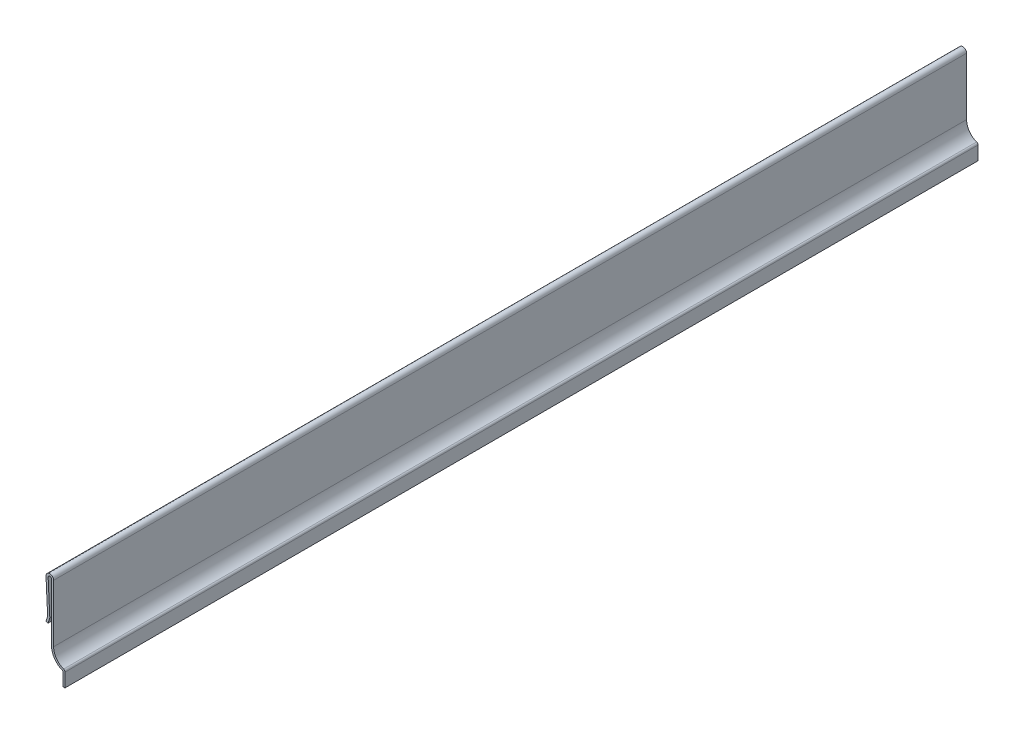
ISO-10303-21;
HEADER;
FILE_DESCRIPTION(('STEP AP214'),'2;1');
FILE_NAME('part.step','',(''),(''),'','','');
FILE_SCHEMA(('AUTOMOTIVE_DESIGN { 1 0 10303 214 1 1 1 1 }'));
ENDSEC;
DATA;
#1=APPLICATION_CONTEXT('core data for automotive mechanical design processes');
#2=APPLICATION_PROTOCOL_DEFINITION('international standard','automotive_design',2000,#1);
#3=PRODUCT_CONTEXT('',#1,'mechanical');
#4=PRODUCT('Part','Part','',(#3));
#5=PRODUCT_RELATED_PRODUCT_CATEGORY('part','',(#4));
#6=PRODUCT_DEFINITION_FORMATION('','',#4);
#7=PRODUCT_DEFINITION_CONTEXT('part definition',#1,'design');
#8=PRODUCT_DEFINITION('design','',#6,#7);
#9=PRODUCT_DEFINITION_SHAPE('','',#8);
#10=(LENGTH_UNIT() NAMED_UNIT(*) SI_UNIT(.MILLI.,.METRE.));
#11=(NAMED_UNIT(*) PLANE_ANGLE_UNIT() SI_UNIT($,.RADIAN.));
#12=(NAMED_UNIT(*) SI_UNIT($,.STERADIAN.) SOLID_ANGLE_UNIT());
#13=UNCERTAINTY_MEASURE_WITH_UNIT(LENGTH_MEASURE(1.E-05),#10,'distance_accuracy_value','');
#14=(GEOMETRIC_REPRESENTATION_CONTEXT(3) GLOBAL_UNCERTAINTY_ASSIGNED_CONTEXT((#13)) GLOBAL_UNIT_ASSIGNED_CONTEXT((#10,
#11,#12)) REPRESENTATION_CONTEXT('',''));
#15=CARTESIAN_POINT('',(0.,0.,0.));
#16=DIRECTION('',(0.,0.,1.));
#17=DIRECTION('',(1.,0.,0.));
#18=AXIS2_PLACEMENT_3D('',#15,#16,#17);
#19=CARTESIAN_POINT('',(0.,0.,-381.));
#20=DIRECTION('',(0.,-1.,0.));
#21=DIRECTION('',(0.,0.,-1.));
#22=AXIS2_PLACEMENT_3D('',#19,#20,#21);
#23=PLANE('',#22);
#24=DIRECTION('',(1.,0.,0.));
#25=VECTOR('',#24,1.);
#26=CARTESIAN_POINT('',(0.,0.,0.));
#27=LINE('',#26,#25);
#28=CARTESIAN_POINT('',(-0.889,0.,0.));
#29=VERTEX_POINT('',#28);
#30=CARTESIAN_POINT('',(0.,0.,0.));
#31=VERTEX_POINT('',#30);
#32=EDGE_CURVE('E211',#29,#31,#27,.T.);
#33=ORIENTED_EDGE('',*,*,#32,.F.);
#34=DIRECTION('',(0.,0.,1.));
#35=VECTOR('',#34,1.);
#36=CARTESIAN_POINT('',(-0.889,0.,-381.));
#37=LINE('',#36,#35);
#38=CARTESIAN_POINT('',(-0.889,0.,-381.));
#39=VERTEX_POINT('',#38);
#40=EDGE_CURVE('E169',#39,#29,#37,.T.);
#41=ORIENTED_EDGE('',*,*,#40,.F.);
#42=DIRECTION('',(1.,0.,0.));
#43=VECTOR('',#42,1.);
#44=CARTESIAN_POINT('',(0.,0.,-381.));
#45=LINE('',#44,#43);
#46=CARTESIAN_POINT('',(0.,0.,-381.));
#47=VERTEX_POINT('',#46);
#48=EDGE_CURVE('E164',#39,#47,#45,.T.);
#49=ORIENTED_EDGE('',*,*,#48,.T.);
#50=DIRECTION('',(0.,0.,1.));
#51=VECTOR('',#50,1.);
#52=CARTESIAN_POINT('',(0.,0.,-381.));
#53=LINE('',#52,#51);
#54=EDGE_CURVE('E146',#47,#31,#53,.T.);
#55=ORIENTED_EDGE('',*,*,#54,.T.);
#56=EDGE_LOOP('',(#33,#41,#49,#55));
#57=FACE_BOUND('',#56,.T.);
#58=ADVANCED_FACE('F35',(#57),#23,.T.);
#59=CARTESIAN_POINT('',(-0.889,0.,-381.));
#60=DIRECTION('',(-1.,0.,0.));
#61=DIRECTION('',(0.,0.,1.));
#62=AXIS2_PLACEMENT_3D('',#59,#60,#61);
#63=PLANE('',#62);
#64=DIRECTION('',(0.,-1.,0.));
#65=VECTOR('',#64,1.);
#66=CARTESIAN_POINT('',(-0.889,0.,0.));
#67=LINE('',#66,#65);
#68=CARTESIAN_POINT('',(-0.888999999999998,5.69615048391721,0.));
#69=VERTEX_POINT('',#68);
#70=EDGE_CURVE('E170',#69,#29,#67,.T.);
#71=ORIENTED_EDGE('',*,*,#70,.F.);
#72=DIRECTION('',(0.,0.,1.));
#73=VECTOR('',#72,1.);
#74=CARTESIAN_POINT('',(-0.888999999999998,5.69615048391721,-381.));
#75=LINE('',#74,#73);
#76=CARTESIAN_POINT('',(-0.888999999999998,5.69615048391721,-381.));
#77=VERTEX_POINT('',#76);
#78=EDGE_CURVE('E250',#77,#69,#75,.T.);
#79=ORIENTED_EDGE('',*,*,#78,.F.);
#80=DIRECTION('',(0.,-1.,0.));
#81=VECTOR('',#80,1.);
#82=CARTESIAN_POINT('',(-0.889,0.,-381.));
#83=LINE('',#82,#81);
#84=EDGE_CURVE('E158',#77,#39,#83,.T.);
#85=ORIENTED_EDGE('',*,*,#84,.T.);
#86=ORIENTED_EDGE('',*,*,#40,.T.);
#87=EDGE_LOOP('',(#71,#79,#85,#86));
#88=FACE_BOUND('',#87,.T.);
#89=ADVANCED_FACE('F280',(#88),#63,.T.);
#90=CARTESIAN_POINT('',(1.5875,12.4983610621043,-381.));
#91=DIRECTION('',(0.,0.,1.));
#92=DIRECTION('',(1.,0.,0.));
#93=AXIS2_PLACEMENT_3D('',#90,#91,#92);
#94=CYLINDRICAL_SURFACE('',#93,7.239);
#95=CARTESIAN_POINT('',(1.5875,12.4983610621043,0.));
#96=DIRECTION('',(0.,0.,1.));
#97=DIRECTION('',(-1.,0.,0.));
#98=AXIS2_PLACEMENT_3D('',#95,#96,#97);
#99=CIRCLE('',#98,7.239);
#100=CARTESIAN_POINT('',(-5.6515,12.4983610621043,0.));
#101=VERTEX_POINT('',#100);
#102=EDGE_CURVE('E173',#101,#69,#99,.T.);
#103=ORIENTED_EDGE('',*,*,#102,.F.);
#104=DIRECTION('',(0.,0.,1.));
#105=VECTOR('',#104,1.);
#106=CARTESIAN_POINT('',(-5.6515,12.4983610621043,-381.));
#107=LINE('',#106,#105);
#108=CARTESIAN_POINT('',(-5.6515,12.4983610621043,-381.));
#109=VERTEX_POINT('',#108);
#110=EDGE_CURVE('E252',#109,#101,#107,.T.);
#111=ORIENTED_EDGE('',*,*,#110,.F.);
#112=CARTESIAN_POINT('',(1.5875,12.4983610621043,-381.));
#113=DIRECTION('',(0.,0.,1.));
#114=DIRECTION('',(-1.,0.,0.));
#115=AXIS2_PLACEMENT_3D('',#112,#113,#114);
#116=CIRCLE('',#115,7.239);
#117=EDGE_CURVE('E207',#109,#77,#116,.T.);
#118=ORIENTED_EDGE('',*,*,#117,.T.);
#119=ORIENTED_EDGE('',*,*,#78,.T.);
#120=EDGE_LOOP('',(#103,#111,#118,#119));
#121=FACE_BOUND('',#120,.T.);
#122=ADVANCED_FACE('F333',(#121),#94,.T.);
#123=CARTESIAN_POINT('',(-5.6515,12.4983610621043,-381.));
#124=DIRECTION('',(-1.,0.,0.));
#125=DIRECTION('',(0.,0.,1.));
#126=AXIS2_PLACEMENT_3D('',#123,#124,#125);
#127=PLANE('',#126);
#128=DIRECTION('',(0.,-1.,0.));
#129=VECTOR('',#128,1.);
#130=CARTESIAN_POINT('',(-5.6515,12.4983610621043,0.));
#131=LINE('',#130,#129);
#132=CARTESIAN_POINT('',(-5.6515,36.5125,0.));
#133=VERTEX_POINT('',#132);
#134=EDGE_CURVE('E243',#133,#101,#131,.T.);
#135=ORIENTED_EDGE('',*,*,#134,.F.);
#136=DIRECTION('',(0.,0.,1.));
#137=VECTOR('',#136,1.);
#138=CARTESIAN_POINT('',(-5.6515,36.5125,-381.));
#139=LINE('',#138,#137);
#140=CARTESIAN_POINT('',(-5.6515,36.5125,-381.));
#141=VERTEX_POINT('',#140);
#142=EDGE_CURVE('E254',#141,#133,#139,.T.);
#143=ORIENTED_EDGE('',*,*,#142,.F.);
#144=DIRECTION('',(0.,-1.,0.));
#145=VECTOR('',#144,1.);
#146=CARTESIAN_POINT('',(-5.6515,12.4983610621043,-381.));
#147=LINE('',#146,#145);
#148=EDGE_CURVE('E204',#141,#109,#147,.T.);
#149=ORIENTED_EDGE('',*,*,#148,.T.);
#150=ORIENTED_EDGE('',*,*,#110,.T.);
#151=EDGE_LOOP('',(#135,#143,#149,#150));
#152=FACE_BOUND('',#151,.T.);
#153=ADVANCED_FACE('F287',(#152),#127,.T.);
#154=CARTESIAN_POINT('',(-6.35,36.5125,-381.));
#155=DIRECTION('',(0.,0.,1.));
#156=DIRECTION('',(1.,0.,0.));
#157=AXIS2_PLACEMENT_3D('',#154,#155,#156);
#158=CYLINDRICAL_SURFACE('',#157,0.698500000000001);
#159=CARTESIAN_POINT('',(-6.35,36.5125,0.));
#160=DIRECTION('',(0.,0.,-1.));
#161=DIRECTION('',(1.,0.,0.));
#162=AXIS2_PLACEMENT_3D('',#159,#160,#161);
#163=CIRCLE('',#162,0.698500000000001);
#164=CARTESIAN_POINT('',(-7.04767876123071,36.4786385746375,0.));
#165=VERTEX_POINT('',#164);
#166=EDGE_CURVE('E240',#165,#133,#163,.T.);
#167=ORIENTED_EDGE('',*,*,#166,.F.);
#168=DIRECTION('',(0.,0.,1.));
#169=VECTOR('',#168,1.);
#170=CARTESIAN_POINT('',(-7.04767876123071,36.4786385746375,-381.));
#171=LINE('',#170,#169);
#172=CARTESIAN_POINT('',(-7.04767876123071,36.4786385746375,-381.));
#173=VERTEX_POINT('',#172);
#174=EDGE_CURVE('E256',#173,#165,#171,.T.);
#175=ORIENTED_EDGE('',*,*,#174,.F.);
#176=CARTESIAN_POINT('',(-6.35,36.5125,-381.));
#177=DIRECTION('',(0.,0.,-1.));
#178=DIRECTION('',(1.,0.,0.));
#179=AXIS2_PLACEMENT_3D('',#176,#177,#178);
#180=CIRCLE('',#179,0.698500000000001);
#181=EDGE_CURVE('E201',#173,#141,#180,.T.);
#182=ORIENTED_EDGE('',*,*,#181,.T.);
#183=ORIENTED_EDGE('',*,*,#142,.T.);
#184=EDGE_LOOP('',(#167,#175,#182,#183));
#185=FACE_BOUND('',#184,.T.);
#186=ADVANCED_FACE('F290',(#185),#158,.F.);
#187=CARTESIAN_POINT('',(-7.04767876123071,36.4786385746375,-381.));
#188=DIRECTION('',(0.998824282363225,0.0484773448281564,0.));
#189=DIRECTION('',(-0.0484773448281564,0.998824282363225,0.));
#190=AXIS2_PLACEMENT_3D('',#187,#188,#189);
#191=PLANE('',#190);
#192=DIRECTION('',(-0.0484773448281564,0.998824282363225,0.));
#193=VECTOR('',#192,1.);
#194=CARTESIAN_POINT('',(-7.04767876123071,36.4786385746375,0.));
#195=LINE('',#194,#193);
#196=CARTESIAN_POINT('',(-6.3579785133294,22.2680963595522,0.));
#197=VERTEX_POINT('',#196);
#198=EDGE_CURVE('E237',#197,#165,#195,.T.);
#199=ORIENTED_EDGE('',*,*,#198,.F.);
#200=DIRECTION('',(0.,0.,1.));
#201=VECTOR('',#200,1.);
#202=CARTESIAN_POINT('',(-6.3579785133294,22.2680963595522,-381.));
#203=LINE('',#202,#201);
#204=CARTESIAN_POINT('',(-6.3579785133294,22.2680963595522,-381.));
#205=VERTEX_POINT('',#204);
#206=EDGE_CURVE('E258',#205,#197,#203,.T.);
#207=ORIENTED_EDGE('',*,*,#206,.F.);
#208=DIRECTION('',(-0.0484773448281564,0.998824282363225,0.));
#209=VECTOR('',#208,1.);
#210=CARTESIAN_POINT('',(-7.04767876123071,36.4786385746375,-381.));
#211=LINE('',#210,#209);
#212=EDGE_CURVE('E198',#205,#173,#211,.T.);
#213=ORIENTED_EDGE('',*,*,#212,.T.);
#214=ORIENTED_EDGE('',*,*,#174,.T.);
#215=EDGE_LOOP('',(#199,#207,#213,#214));
#216=FACE_BOUND('',#215,.T.);
#217=ADVANCED_FACE('F295',(#216),#191,.T.);
#218=CARTESIAN_POINT('',(-7.24593330035031,22.225,-381.));
#219=DIRECTION('',(0.,0.,1.));
#220=DIRECTION('',(1.,0.,0.));
#221=AXIS2_PLACEMENT_3D('',#218,#219,#220);
#222=CYLINDRICAL_SURFACE('',#221,0.888999999999999);
#223=CARTESIAN_POINT('',(-7.24593330035031,22.225,0.));
#224=DIRECTION('',(0.,0.,1.));
#225=DIRECTION('',(-1.,0.,0.));
#226=AXIS2_PLACEMENT_3D('',#223,#224,#225);
#227=CIRCLE('',#226,0.888999999999999);
#228=CARTESIAN_POINT('',(-6.40140049114408,21.9473575425584,0.));
#229=VERTEX_POINT('',#228);
#230=EDGE_CURVE('E234',#229,#197,#227,.T.);
#231=ORIENTED_EDGE('',*,*,#230,.F.);
#232=DIRECTION('',(0.,0.,1.));
#233=VECTOR('',#232,1.);
#234=CARTESIAN_POINT('',(-6.40140049114408,21.9473575425584,-381.));
#235=LINE('',#234,#233);
#236=CARTESIAN_POINT('',(-6.40140049114408,21.9473575425584,-381.));
#237=VERTEX_POINT('',#236);
#238=EDGE_CURVE('E260',#237,#229,#235,.T.);
#239=ORIENTED_EDGE('',*,*,#238,.F.);
#240=CARTESIAN_POINT('',(-7.24593330035031,22.225,-381.));
#241=DIRECTION('',(0.,0.,1.));
#242=DIRECTION('',(-1.,0.,0.));
#243=AXIS2_PLACEMENT_3D('',#240,#241,#242);
#244=CIRCLE('',#243,0.888999999999999);
#245=EDGE_CURVE('E195',#237,#205,#244,.T.);
#246=ORIENTED_EDGE('',*,*,#245,.T.);
#247=ORIENTED_EDGE('',*,*,#206,.T.);
#248=EDGE_LOOP('',(#231,#239,#246,#247));
#249=FACE_BOUND('',#248,.T.);
#250=ADVANCED_FACE('F298',(#249),#222,.T.);
#251=CARTESIAN_POINT('',(-6.40140049114408,21.9473575425584,-381.));
#252=DIRECTION('',(0.949980662774169,-0.312308726031069,0.));
#253=DIRECTION('',(0.31230872603107,0.94998066277417,0.));
#254=AXIS2_PLACEMENT_3D('',#251,#252,#253);
#255=PLANE('',#254);
#256=DIRECTION('',(0.312308726031069,0.949980662774169,0.));
#257=VECTOR('',#256,1.);
#258=CARTESIAN_POINT('',(-6.40140049114408,21.9473575425584,0.));
#259=LINE('',#258,#257);
#260=CARTESIAN_POINT('',(-7.09296719079376,19.84375,0.));
#261=VERTEX_POINT('',#260);
#262=EDGE_CURVE('E231',#261,#229,#259,.T.);
#263=ORIENTED_EDGE('',*,*,#262,.F.);
#264=DIRECTION('',(0.,0.,1.));
#265=VECTOR('',#264,1.);
#266=CARTESIAN_POINT('',(-7.09296719079376,19.84375,-381.));
#267=LINE('',#266,#265);
#268=CARTESIAN_POINT('',(-7.09296719079376,19.84375,-381.));
#269=VERTEX_POINT('',#268);
#270=EDGE_CURVE('E262',#269,#261,#267,.T.);
#271=ORIENTED_EDGE('',*,*,#270,.F.);
#272=DIRECTION('',(0.312308726031069,0.949980662774169,0.));
#273=VECTOR('',#272,1.);
#274=CARTESIAN_POINT('',(-6.40140049114408,21.9473575425584,-381.));
#275=LINE('',#274,#273);
#276=EDGE_CURVE('E192',#269,#237,#275,.T.);
#277=ORIENTED_EDGE('',*,*,#276,.T.);
#278=ORIENTED_EDGE('',*,*,#238,.T.);
#279=EDGE_LOOP('',(#263,#271,#277,#278));
#280=FACE_BOUND('',#279,.T.);
#281=ADVANCED_FACE('F303',(#280),#255,.T.);
#282=CARTESIAN_POINT('',(-7.93750000000001,20.1213924574416,-381.));
#283=DIRECTION('',(-0.31230872603107,-0.949980662774169,0.));
#284=DIRECTION('',(0.949980662774169,-0.31230872603107,0.));
#285=AXIS2_PLACEMENT_3D('',#282,#283,#284);
#286=PLANE('',#285);
#287=DIRECTION('',(0.949980662774169,-0.31230872603107,0.));
#288=VECTOR('',#287,1.);
#289=CARTESIAN_POINT('',(-7.93750000000001,20.1213924574416,0.));
#290=LINE('',#289,#288);
#291=CARTESIAN_POINT('',(-7.93750000000001,20.1213924574416,0.));
#292=VERTEX_POINT('',#291);
#293=EDGE_CURVE('E228',#292,#261,#290,.T.);
#294=ORIENTED_EDGE('',*,*,#293,.F.);
#295=DIRECTION('',(0.,0.,1.));
#296=VECTOR('',#295,1.);
#297=CARTESIAN_POINT('',(-7.93750000000001,20.1213924574416,-381.));
#298=LINE('',#297,#296);
#299=CARTESIAN_POINT('',(-7.93750000000001,20.1213924574416,-381.));
#300=VERTEX_POINT('',#299);
#301=EDGE_CURVE('E264',#300,#292,#298,.T.);
#302=ORIENTED_EDGE('',*,*,#301,.F.);
#303=DIRECTION('',(0.949980662774169,-0.31230872603107,0.));
#304=VECTOR('',#303,1.);
#305=CARTESIAN_POINT('',(-7.93750000000001,20.1213924574416,-381.));
#306=LINE('',#305,#304);
#307=EDGE_CURVE('E189',#300,#269,#306,.T.);
#308=ORIENTED_EDGE('',*,*,#307,.T.);
#309=ORIENTED_EDGE('',*,*,#270,.T.);
#310=EDGE_LOOP('',(#294,#302,#308,#309));
#311=FACE_BOUND('',#310,.T.);
#312=ADVANCED_FACE('F306',(#311),#286,.T.);
#313=CARTESIAN_POINT('',(-7.24593330035032,22.225,-381.));
#314=DIRECTION('',(-0.949980662774169,0.312308726031071,0.));
#315=DIRECTION('',(-0.312308726031071,-0.949980662774169,0.));
#316=AXIS2_PLACEMENT_3D('',#313,#314,#315);
#317=PLANE('',#316);
#318=DIRECTION('',(-0.312308726031071,-0.949980662774169,0.));
#319=VECTOR('',#318,1.);
#320=CARTESIAN_POINT('',(-7.24593330035032,22.225,0.));
#321=LINE('',#320,#319);
#322=CARTESIAN_POINT('',(-7.24593330035032,22.225,0.));
#323=VERTEX_POINT('',#322);
#324=EDGE_CURVE('E225',#323,#292,#321,.T.);
#325=ORIENTED_EDGE('',*,*,#324,.F.);
#326=DIRECTION('',(0.,0.,1.));
#327=VECTOR('',#326,1.);
#328=CARTESIAN_POINT('',(-7.24593330035032,22.225,-381.));
#329=LINE('',#328,#327);
#330=CARTESIAN_POINT('',(-7.24593330035032,22.225,-381.));
#331=VERTEX_POINT('',#330);
#332=EDGE_CURVE('E266',#331,#323,#329,.T.);
#333=ORIENTED_EDGE('',*,*,#332,.F.);
#334=DIRECTION('',(-0.312308726031071,-0.949980662774169,0.));
#335=VECTOR('',#334,1.);
#336=CARTESIAN_POINT('',(-7.24593330035032,22.225,-381.));
#337=LINE('',#336,#335);
#338=EDGE_CURVE('E186',#331,#300,#337,.T.);
#339=ORIENTED_EDGE('',*,*,#338,.T.);
#340=ORIENTED_EDGE('',*,*,#301,.T.);
#341=EDGE_LOOP('',(#325,#333,#339,#340));
#342=FACE_BOUND('',#341,.T.);
#343=ADVANCED_FACE('F311',(#342),#317,.T.);
#344=CARTESIAN_POINT('',(-7.93563354825162,36.4355422150853,-381.));
#345=DIRECTION('',(-0.998824282363225,-0.0484773448281561,0.));
#346=DIRECTION('',(0.0484773448281561,-0.998824282363225,0.));
#347=AXIS2_PLACEMENT_3D('',#344,#345,#346);
#348=PLANE('',#347);
#349=DIRECTION('',(0.0484773448281561,-0.998824282363225,0.));
#350=VECTOR('',#349,1.);
#351=CARTESIAN_POINT('',(-7.93563354825162,36.4355422150853,0.));
#352=LINE('',#351,#350);
#353=CARTESIAN_POINT('',(-7.93563354825162,36.4355422150853,0.));
#354=VERTEX_POINT('',#353);
#355=EDGE_CURVE('E222',#354,#323,#352,.T.);
#356=ORIENTED_EDGE('',*,*,#355,.F.);
#357=DIRECTION('',(0.,0.,1.));
#358=VECTOR('',#357,1.);
#359=CARTESIAN_POINT('',(-7.93563354825162,36.4355422150853,-381.));
#360=LINE('',#359,#358);
#361=CARTESIAN_POINT('',(-7.93563354825162,36.4355422150853,-381.));
#362=VERTEX_POINT('',#361);
#363=EDGE_CURVE('E268',#362,#354,#360,.T.);
#364=ORIENTED_EDGE('',*,*,#363,.F.);
#365=DIRECTION('',(0.0484773448281561,-0.998824282363225,0.));
#366=VECTOR('',#365,1.);
#367=CARTESIAN_POINT('',(-7.93563354825162,36.4355422150853,-381.));
#368=LINE('',#367,#366);
#369=EDGE_CURVE('E183',#362,#331,#368,.T.);
#370=ORIENTED_EDGE('',*,*,#369,.T.);
#371=ORIENTED_EDGE('',*,*,#332,.T.);
#372=EDGE_LOOP('',(#356,#364,#370,#371));
#373=FACE_BOUND('',#372,.T.);
#374=ADVANCED_FACE('F314',(#373),#348,.T.);
#375=CARTESIAN_POINT('',(-6.35,36.5125,-381.));
#376=DIRECTION('',(0.,0.,1.));
#377=DIRECTION('',(1.,0.,0.));
#378=AXIS2_PLACEMENT_3D('',#375,#376,#377);
#379=CYLINDRICAL_SURFACE('',#378,1.5875);
#380=CARTESIAN_POINT('',(-6.35,36.5125,0.));
#381=DIRECTION('',(0.,0.,1.));
#382=DIRECTION('',(1.,0.,0.));
#383=AXIS2_PLACEMENT_3D('',#380,#381,#382);
#384=CIRCLE('',#383,1.5875);
#385=CARTESIAN_POINT('',(-4.7625,36.5125,0.));
#386=VERTEX_POINT('',#385);
#387=EDGE_CURVE('E219',#386,#354,#384,.T.);
#388=ORIENTED_EDGE('',*,*,#387,.F.);
#389=DIRECTION('',(0.,0.,1.));
#390=VECTOR('',#389,1.);
#391=CARTESIAN_POINT('',(-4.7625,36.5125,-381.));
#392=LINE('',#391,#390);
#393=CARTESIAN_POINT('',(-4.7625,36.5125,-381.));
#394=VERTEX_POINT('',#393);
#395=EDGE_CURVE('E270',#394,#386,#392,.T.);
#396=ORIENTED_EDGE('',*,*,#395,.F.);
#397=CARTESIAN_POINT('',(-6.35,36.5125,-381.));
#398=DIRECTION('',(0.,0.,1.));
#399=DIRECTION('',(1.,0.,0.));
#400=AXIS2_PLACEMENT_3D('',#397,#398,#399);
#401=CIRCLE('',#400,1.5875);
#402=EDGE_CURVE('E180',#394,#362,#401,.T.);
#403=ORIENTED_EDGE('',*,*,#402,.T.);
#404=ORIENTED_EDGE('',*,*,#363,.T.);
#405=EDGE_LOOP('',(#388,#396,#403,#404));
#406=FACE_BOUND('',#405,.T.);
#407=ADVANCED_FACE('F319',(#406),#379,.T.);
#408=CARTESIAN_POINT('',(-4.7625,12.4983610621043,-381.));
#409=DIRECTION('',(1.,0.,0.));
#410=DIRECTION('',(0.,0.,-1.));
#411=AXIS2_PLACEMENT_3D('',#408,#409,#410);
#412=PLANE('',#411);
#413=DIRECTION('',(0.,1.,0.));
#414=VECTOR('',#413,1.);
#415=CARTESIAN_POINT('',(-4.7625,12.4983610621043,0.));
#416=LINE('',#415,#414);
#417=CARTESIAN_POINT('',(-4.7625,12.4983610621043,0.));
#418=VERTEX_POINT('',#417);
#419=EDGE_CURVE('E216',#418,#386,#416,.T.);
#420=ORIENTED_EDGE('',*,*,#419,.F.);
#421=DIRECTION('',(0.,0.,1.));
#422=VECTOR('',#421,1.);
#423=CARTESIAN_POINT('',(-4.7625,12.4983610621043,-381.));
#424=LINE('',#423,#422);
#425=CARTESIAN_POINT('',(-4.7625,12.4983610621043,-381.));
#426=VERTEX_POINT('',#425);
#427=EDGE_CURVE('E157',#426,#418,#424,.T.);
#428=ORIENTED_EDGE('',*,*,#427,.F.);
#429=DIRECTION('',(0.,1.,0.));
#430=VECTOR('',#429,1.);
#431=CARTESIAN_POINT('',(-4.7625,12.4983610621043,-381.));
#432=LINE('',#431,#430);
#433=EDGE_CURVE('E177',#426,#394,#432,.T.);
#434=ORIENTED_EDGE('',*,*,#433,.T.);
#435=ORIENTED_EDGE('',*,*,#395,.T.);
#436=EDGE_LOOP('',(#420,#428,#434,#435));
#437=FACE_BOUND('',#436,.T.);
#438=ADVANCED_FACE('F322',(#437),#412,.T.);
#439=CARTESIAN_POINT('',(1.5875,12.4983610621043,-381.));
#440=DIRECTION('',(0.,0.,1.));
#441=DIRECTION('',(1.,0.,0.));
#442=AXIS2_PLACEMENT_3D('',#439,#440,#441);
#443=CYLINDRICAL_SURFACE('',#442,6.35);
#444=CARTESIAN_POINT('',(1.5875,12.4983610621043,0.));
#445=DIRECTION('',(0.,0.,-1.));
#446=DIRECTION('',(-1.,0.,0.));
#447=AXIS2_PLACEMENT_3D('',#444,#445,#446);
#448=CIRCLE('',#447,6.35);
#449=CARTESIAN_POINT('',(-0.584868421052632,6.53150967772966,0.));
#450=VERTEX_POINT('',#449);
#451=EDGE_CURVE('E214',#450,#418,#448,.T.);
#452=ORIENTED_EDGE('',*,*,#451,.F.);
#453=DIRECTION('',(0.,0.,1.));
#454=VECTOR('',#453,1.);
#455=CARTESIAN_POINT('',(-0.584868421052632,6.53150967772966,-381.));
#456=LINE('',#455,#454);
#457=CARTESIAN_POINT('',(-0.584868421052632,6.53150967772966,-381.));
#458=VERTEX_POINT('',#457);
#459=EDGE_CURVE('E43',#450,#458,#456,.F.);
#460=ORIENTED_EDGE('',*,*,#459,.T.);
#461=CARTESIAN_POINT('',(1.5875,12.4983610621043,-381.));
#462=DIRECTION('',(0.,0.,-1.));
#463=DIRECTION('',(-1.,0.,0.));
#464=AXIS2_PLACEMENT_3D('',#461,#462,#463);
#465=CIRCLE('',#464,6.35);
#466=EDGE_CURVE('E167',#458,#426,#465,.T.);
#467=ORIENTED_EDGE('',*,*,#466,.T.);
#468=ORIENTED_EDGE('',*,*,#427,.T.);
#469=EDGE_LOOP('',(#452,#460,#467,#468));
#470=FACE_BOUND('',#469,.T.);
#471=ADVANCED_FACE('F338',(#470),#443,.F.);
#472=CARTESIAN_POINT('',(0.,0.,-381.));
#473=DIRECTION('',(1.,0.,0.));
#474=DIRECTION('',(0.,0.,-1.));
#475=AXIS2_PLACEMENT_3D('',#472,#473,#474);
#476=PLANE('',#475);
#477=DIRECTION('',(0.,1.,0.));
#478=VECTOR('',#477,1.);
#479=CARTESIAN_POINT('',(0.,0.,-381.));
#480=LINE('',#479,#478);
#481=CARTESIAN_POINT('',(0.,5.69615048391721,-381.));
#482=VERTEX_POINT('',#481);
#483=EDGE_CURVE('E150',#47,#482,#480,.T.);
#484=ORIENTED_EDGE('',*,*,#483,.T.);
#485=DIRECTION('',(0.,0.,1.));
#486=VECTOR('',#485,1.);
#487=CARTESIAN_POINT('',(0.,5.69615048391721,-381.));
#488=LINE('',#487,#486);
#489=CARTESIAN_POINT('',(0.,5.69615048391721,0.));
#490=VERTEX_POINT('',#489);
#491=EDGE_CURVE('E249',#482,#490,#488,.T.);
#492=ORIENTED_EDGE('',*,*,#491,.T.);
#493=DIRECTION('',(0.,1.,0.));
#494=VECTOR('',#493,1.);
#495=CARTESIAN_POINT('',(0.,0.,0.));
#496=LINE('',#495,#494);
#497=EDGE_CURVE('E152',#31,#490,#496,.T.);
#498=ORIENTED_EDGE('',*,*,#497,.F.);
#499=ORIENTED_EDGE('',*,*,#54,.F.);
#500=EDGE_LOOP('',(#484,#492,#498,#499));
#501=FACE_BOUND('',#500,.T.);
#502=ADVANCED_FACE('F148',(#501),#476,.T.);
#503=CARTESIAN_POINT('',(1.5875,12.4983610621043,-381.));
#504=DIRECTION('',(0.,0.,-1.));
#505=DIRECTION('',(-1.,0.,0.));
#506=AXIS2_PLACEMENT_3D('',#503,#504,#505);
#507=PLANE('',#506);
#508=ORIENTED_EDGE('',*,*,#466,.F.);
#509=CARTESIAN_POINT('',(-0.889,5.69615048391721,-381.));
#510=DIRECTION('',(0.,0.,-1.));
#511=DIRECTION('',(-1.,0.,0.));
#512=AXIS2_PLACEMENT_3D('',#509,#510,#511);
#513=CIRCLE('',#512,0.889);
#514=EDGE_CURVE('E11',#458,#482,#513,.T.);
#515=ORIENTED_EDGE('',*,*,#514,.T.);
#516=ORIENTED_EDGE('',*,*,#483,.F.);
#517=ORIENTED_EDGE('',*,*,#48,.F.);
#518=ORIENTED_EDGE('',*,*,#84,.F.);
#519=ORIENTED_EDGE('',*,*,#117,.F.);
#520=ORIENTED_EDGE('',*,*,#148,.F.);
#521=ORIENTED_EDGE('',*,*,#181,.F.);
#522=ORIENTED_EDGE('',*,*,#212,.F.);
#523=ORIENTED_EDGE('',*,*,#245,.F.);
#524=ORIENTED_EDGE('',*,*,#276,.F.);
#525=ORIENTED_EDGE('',*,*,#307,.F.);
#526=ORIENTED_EDGE('',*,*,#338,.F.);
#527=ORIENTED_EDGE('',*,*,#369,.F.);
#528=ORIENTED_EDGE('',*,*,#402,.F.);
#529=ORIENTED_EDGE('',*,*,#433,.F.);
#530=EDGE_LOOP('',(#508,#515,#516,#517,#518,#519,#520,#521,#522,#523,#524,#525,#526,#527,#528,#529));
#531=FACE_BOUND('',#530,.T.);
#532=ADVANCED_FACE('F162',(#531),#507,.T.);
#533=CARTESIAN_POINT('',(1.5875,12.4983610621043,0.));
#534=DIRECTION('',(0.,0.,-1.));
#535=DIRECTION('',(-1.,0.,0.));
#536=AXIS2_PLACEMENT_3D('',#533,#534,#535);
#537=PLANE('',#536);
#538=ORIENTED_EDGE('',*,*,#497,.T.);
#539=CARTESIAN_POINT('',(-0.889,5.69615048391721,0.));
#540=DIRECTION('',(0.,0.,-1.));
#541=DIRECTION('',(-1.,0.,0.));
#542=AXIS2_PLACEMENT_3D('',#539,#540,#541);
#543=CIRCLE('',#542,0.889);
#544=EDGE_CURVE('E57',#490,#450,#543,.F.);
#545=ORIENTED_EDGE('',*,*,#544,.T.);
#546=ORIENTED_EDGE('',*,*,#451,.T.);
#547=ORIENTED_EDGE('',*,*,#419,.T.);
#548=ORIENTED_EDGE('',*,*,#387,.T.);
#549=ORIENTED_EDGE('',*,*,#355,.T.);
#550=ORIENTED_EDGE('',*,*,#324,.T.);
#551=ORIENTED_EDGE('',*,*,#293,.T.);
#552=ORIENTED_EDGE('',*,*,#262,.T.);
#553=ORIENTED_EDGE('',*,*,#230,.T.);
#554=ORIENTED_EDGE('',*,*,#198,.T.);
#555=ORIENTED_EDGE('',*,*,#166,.T.);
#556=ORIENTED_EDGE('',*,*,#134,.T.);
#557=ORIENTED_EDGE('',*,*,#102,.T.);
#558=ORIENTED_EDGE('',*,*,#70,.T.);
#559=ORIENTED_EDGE('',*,*,#32,.T.);
#560=EDGE_LOOP('',(#538,#545,#546,#547,#548,#549,#550,#551,#552,#553,#554,#555,#556,#557,#558,#559));
#561=FACE_BOUND('',#560,.T.);
#562=ADVANCED_FACE('F276',(#561),#537,.F.);
#563=CARTESIAN_POINT('',(-0.889,5.69615048391721,-381.));
#564=DIRECTION('',(0.,0.,1.));
#565=DIRECTION('',(1.,0.,0.));
#566=AXIS2_PLACEMENT_3D('',#563,#564,#565);
#567=CYLINDRICAL_SURFACE('',#566,0.889);
#568=ORIENTED_EDGE('',*,*,#514,.F.);
#569=ORIENTED_EDGE('',*,*,#459,.F.);
#570=ORIENTED_EDGE('',*,*,#544,.F.);
#571=ORIENTED_EDGE('',*,*,#491,.F.);
#572=EDGE_LOOP('',(#568,#569,#570,#571));
#573=FACE_BOUND('',#572,.T.);
#574=ADVANCED_FACE('F37',(#573),#567,.T.);
#575=CLOSED_SHELL('',(#58,#89,#122,#153,#186,#217,#250,#281,#312,#343,#374,#407,#438,#471,#502,
#532,#562,#574));
#576=MANIFOLD_SOLID_BREP('B2',#575);
#577=ADVANCED_BREP_SHAPE_REPRESENTATION('',(#18,#576),#14);
#578=SHAPE_DEFINITION_REPRESENTATION(#9,#577);
ENDSEC;
END-ISO-10303-21;
